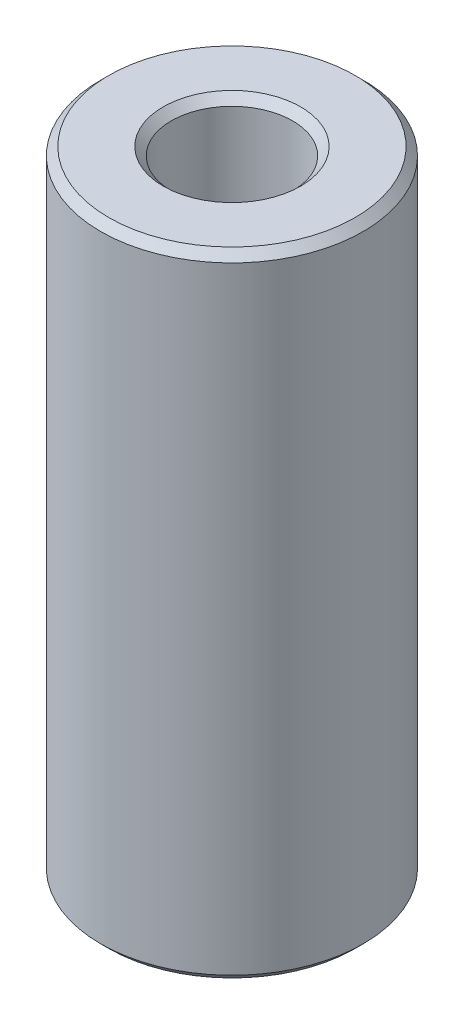
ISO-10303-21;
HEADER;
FILE_DESCRIPTION(('STEP AP214'),'2;1');
FILE_NAME('part.step','',(''),(''),'','','');
FILE_SCHEMA(('AUTOMOTIVE_DESIGN { 1 0 10303 214 1 1 1 1 }'));
ENDSEC;
DATA;
#1=APPLICATION_CONTEXT('core data for automotive mechanical design processes');
#2=APPLICATION_PROTOCOL_DEFINITION('international standard','automotive_design',2000,#1);
#3=PRODUCT_CONTEXT('',#1,'mechanical');
#4=PRODUCT('Part','Part','',(#3));
#5=PRODUCT_RELATED_PRODUCT_CATEGORY('part','',(#4));
#6=PRODUCT_DEFINITION_FORMATION('','',#4);
#7=PRODUCT_DEFINITION_CONTEXT('part definition',#1,'design');
#8=PRODUCT_DEFINITION('design','',#6,#7);
#9=PRODUCT_DEFINITION_SHAPE('','',#8);
#10=(LENGTH_UNIT() NAMED_UNIT(*) SI_UNIT(.MILLI.,.METRE.));
#11=(NAMED_UNIT(*) PLANE_ANGLE_UNIT() SI_UNIT($,.RADIAN.));
#12=(NAMED_UNIT(*) SI_UNIT($,.STERADIAN.) SOLID_ANGLE_UNIT());
#13=UNCERTAINTY_MEASURE_WITH_UNIT(LENGTH_MEASURE(1.E-05),#10,'distance_accuracy_value','');
#14=(GEOMETRIC_REPRESENTATION_CONTEXT(3) GLOBAL_UNCERTAINTY_ASSIGNED_CONTEXT((#13)) GLOBAL_UNIT_ASSIGNED_CONTEXT((#10,
#11,#12)) REPRESENTATION_CONTEXT('',''));
#15=CARTESIAN_POINT('',(0.,0.,0.));
#16=DIRECTION('',(0.,0.,1.));
#17=DIRECTION('',(1.,0.,0.));
#18=AXIS2_PLACEMENT_3D('',#15,#16,#17);
#19=CARTESIAN_POINT('',(0.,72.3606746564202,0.));
#20=DIRECTION('',(0.,-1.,0.));
#21=DIRECTION('',(0.,0.,-1.));
#22=AXIS2_PLACEMENT_3D('',#19,#20,#21);
#23=CYLINDRICAL_SURFACE('',#22,15.);
#24=CARTESIAN_POINT('',(0.,0.922647919036457,0.));
#25=DIRECTION('',(0.,1.,0.));
#26=DIRECTION('',(0.,0.,1.));
#27=AXIS2_PLACEMENT_3D('',#24,#25,#26);
#28=CIRCLE('',#27,15.);
#29=CARTESIAN_POINT('',(0.,0.922647919036457,15.));
#30=VERTEX_POINT('',#29);
#31=EDGE_CURVE('E10',#30,#30,#28,.T.);
#32=ORIENTED_EDGE('',*,*,#31,.T.);
#33=EDGE_LOOP('',(#32));
#34=FACE_BOUND('',#33,.T.);
#35=CARTESIAN_POINT('',(0.,71.4380267373838,0.));
#36=DIRECTION('',(0.,1.,0.));
#37=DIRECTION('',(0.,0.,1.));
#38=AXIS2_PLACEMENT_3D('',#35,#36,#37);
#39=CIRCLE('',#38,15.);
#40=CARTESIAN_POINT('',(0.,71.4380267373838,15.));
#41=VERTEX_POINT('',#40);
#42=EDGE_CURVE('E50',#41,#41,#39,.F.);
#43=ORIENTED_EDGE('',*,*,#42,.T.);
#44=EDGE_LOOP('',(#43));
#45=FACE_BOUND('',#44,.T.);
#46=ADVANCED_FACE('F39',(#34,#45),#23,.T.);
#47=CARTESIAN_POINT('',(0.,72.3606746564202,0.));
#48=DIRECTION('',(0.,1.,0.));
#49=DIRECTION('',(0.,0.,1.));
#50=AXIS2_PLACEMENT_3D('',#47,#48,#49);
#51=PLANE('',#50);
#52=CARTESIAN_POINT('',(0.,72.3606746564202,0.));
#53=DIRECTION('',(0.,1.,0.));
#54=DIRECTION('',(0.,0.,1.));
#55=AXIS2_PLACEMENT_3D('',#52,#53,#54);
#56=CIRCLE('',#55,7.85664186488703);
#57=CARTESIAN_POINT('',(0.,72.3606746564202,7.85664186488703));
#58=VERTEX_POINT('',#57);
#59=EDGE_CURVE('E58',#58,#58,#56,.F.);
#60=ORIENTED_EDGE('',*,*,#59,.T.);
#61=EDGE_LOOP('',(#60));
#62=FACE_BOUND('',#61,.T.);
#63=CARTESIAN_POINT('',(0.,72.3606746564202,0.));
#64=DIRECTION('',(0.,1.,0.));
#65=DIRECTION('',(0.,0.,1.));
#66=AXIS2_PLACEMENT_3D('',#63,#64,#65);
#67=CIRCLE('',#66,14.0773520809635);
#68=CARTESIAN_POINT('',(0.,72.3606746564202,14.0773520809635));
#69=VERTEX_POINT('',#68);
#70=EDGE_CURVE('E61',#69,#69,#67,.T.);
#71=ORIENTED_EDGE('',*,*,#70,.T.);
#72=EDGE_LOOP('',(#71));
#73=FACE_BOUND('',#72,.T.);
#74=ADVANCED_FACE('F88',(#62,#73),#51,.T.);
#75=CARTESIAN_POINT('',(0.,0.,0.));
#76=DIRECTION('',(0.,1.,0.));
#77=DIRECTION('',(0.,0.,1.));
#78=AXIS2_PLACEMENT_3D('',#75,#76,#77);
#79=PLANE('',#78);
#80=CARTESIAN_POINT('',(0.,0.,0.));
#81=DIRECTION('',(0.,1.,0.));
#82=DIRECTION('',(0.,0.,1.));
#83=AXIS2_PLACEMENT_3D('',#80,#81,#82);
#84=CIRCLE('',#83,7.85664186488703);
#85=CARTESIAN_POINT('',(0.,0.,7.85664186488703));
#86=VERTEX_POINT('',#85);
#87=EDGE_CURVE('E51',#86,#86,#84,.T.);
#88=ORIENTED_EDGE('',*,*,#87,.T.);
#89=EDGE_LOOP('',(#88));
#90=FACE_BOUND('',#89,.T.);
#91=CARTESIAN_POINT('',(0.,0.,0.));
#92=DIRECTION('',(0.,1.,0.));
#93=DIRECTION('',(0.,0.,1.));
#94=AXIS2_PLACEMENT_3D('',#91,#92,#93);
#95=CIRCLE('',#94,14.0773520809635);
#96=CARTESIAN_POINT('',(0.,0.,14.0773520809635));
#97=VERTEX_POINT('',#96);
#98=EDGE_CURVE('E54',#97,#97,#95,.F.);
#99=ORIENTED_EDGE('',*,*,#98,.T.);
#100=EDGE_LOOP('',(#99));
#101=FACE_BOUND('',#100,.T.);
#102=ADVANCED_FACE('F83',(#90,#101),#79,.F.);
#103=CARTESIAN_POINT('',(0.,72.3606746564202,0.));
#104=DIRECTION('',(0.,-1.,0.));
#105=DIRECTION('',(0.,0.,-1.));
#106=AXIS2_PLACEMENT_3D('',#103,#104,#105);
#107=CYLINDRICAL_SURFACE('',#106,6.93399394585056);
#108=CARTESIAN_POINT('',(0.,71.4380267373837,0.));
#109=DIRECTION('',(0.,1.,0.));
#110=DIRECTION('',(0.,0.,1.));
#111=AXIS2_PLACEMENT_3D('',#108,#109,#110);
#112=CIRCLE('',#111,6.93399394585056);
#113=CARTESIAN_POINT('',(0.,71.4380267373837,6.93399394585056));
#114=VERTEX_POINT('',#113);
#115=EDGE_CURVE('E67',#114,#114,#112,.T.);
#116=ORIENTED_EDGE('',*,*,#115,.T.);
#117=EDGE_LOOP('',(#116));
#118=FACE_BOUND('',#117,.T.);
#119=CARTESIAN_POINT('',(0.,0.922647919036484,0.));
#120=DIRECTION('',(0.,1.,0.));
#121=DIRECTION('',(0.,0.,1.));
#122=AXIS2_PLACEMENT_3D('',#119,#120,#121);
#123=CIRCLE('',#122,6.93399394585056);
#124=CARTESIAN_POINT('',(0.,0.922647919036484,6.93399394585056));
#125=VERTEX_POINT('',#124);
#126=EDGE_CURVE('E69',#125,#125,#123,.F.);
#127=ORIENTED_EDGE('',*,*,#126,.T.);
#128=EDGE_LOOP('',(#127));
#129=FACE_BOUND('',#128,.T.);
#130=ADVANCED_FACE('F71',(#118,#129),#107,.F.);
#131=CARTESIAN_POINT('',(0.,71.4380267373837,0.));
#132=DIRECTION('',(0.,1.,0.));
#133=DIRECTION('',(0.,0.,1.));
#134=AXIS2_PLACEMENT_3D('',#131,#132,#133);
#135=CONICAL_SURFACE('',#134,6.93399394585056,0.78539816339744);
#136=ORIENTED_EDGE('',*,*,#59,.F.);
#137=EDGE_LOOP('',(#136));
#138=FACE_BOUND('',#137,.T.);
#139=ORIENTED_EDGE('',*,*,#115,.F.);
#140=EDGE_LOOP('',(#139));
#141=FACE_BOUND('',#140,.T.);
#142=ADVANCED_FACE('F77',(#138,#141),#135,.F.);
#143=CARTESIAN_POINT('',(0.,0.,0.));
#144=DIRECTION('',(0.,-1.,0.));
#145=DIRECTION('',(0.,0.,-1.));
#146=AXIS2_PLACEMENT_3D('',#143,#144,#145);
#147=CONICAL_SURFACE('',#146,7.85664186488703,0.785398163397444);
#148=ORIENTED_EDGE('',*,*,#126,.F.);
#149=EDGE_LOOP('',(#148));
#150=FACE_BOUND('',#149,.T.);
#151=ORIENTED_EDGE('',*,*,#87,.F.);
#152=EDGE_LOOP('',(#151));
#153=FACE_BOUND('',#152,.T.);
#154=ADVANCED_FACE('F73',(#150,#153),#147,.F.);
#155=CARTESIAN_POINT('',(0.,0.922647919036457,0.));
#156=DIRECTION('',(0.,1.,0.));
#157=DIRECTION('',(0.,0.,1.));
#158=AXIS2_PLACEMENT_3D('',#155,#156,#157);
#159=CONICAL_SURFACE('',#158,15.,0.785398163397452);
#160=ORIENTED_EDGE('',*,*,#98,.F.);
#161=EDGE_LOOP('',(#160));
#162=FACE_BOUND('',#161,.T.);
#163=ORIENTED_EDGE('',*,*,#31,.F.);
#164=EDGE_LOOP('',(#163));
#165=FACE_BOUND('',#164,.T.);
#166=ADVANCED_FACE('F76',(#162,#165),#159,.T.);
#167=CARTESIAN_POINT('',(0.,72.3606746564202,0.));
#168=DIRECTION('',(0.,-1.,0.));
#169=DIRECTION('',(0.,0.,-1.));
#170=AXIS2_PLACEMENT_3D('',#167,#168,#169);
#171=CONICAL_SURFACE('',#170,14.0773520809635,0.785398163397452);
#172=ORIENTED_EDGE('',*,*,#42,.F.);
#173=EDGE_LOOP('',(#172));
#174=FACE_BOUND('',#173,.T.);
#175=ORIENTED_EDGE('',*,*,#70,.F.);
#176=EDGE_LOOP('',(#175));
#177=FACE_BOUND('',#176,.T.);
#178=ADVANCED_FACE('F45',(#174,#177),#171,.T.);
#179=CLOSED_SHELL('',(#46,#74,#102,#130,#142,#154,#166,#178));
#180=MANIFOLD_SOLID_BREP('B2',#179);
#181=ADVANCED_BREP_SHAPE_REPRESENTATION('',(#18,#180),#14);
#182=SHAPE_DEFINITION_REPRESENTATION(#9,#181);
ENDSEC;
END-ISO-10303-21;
